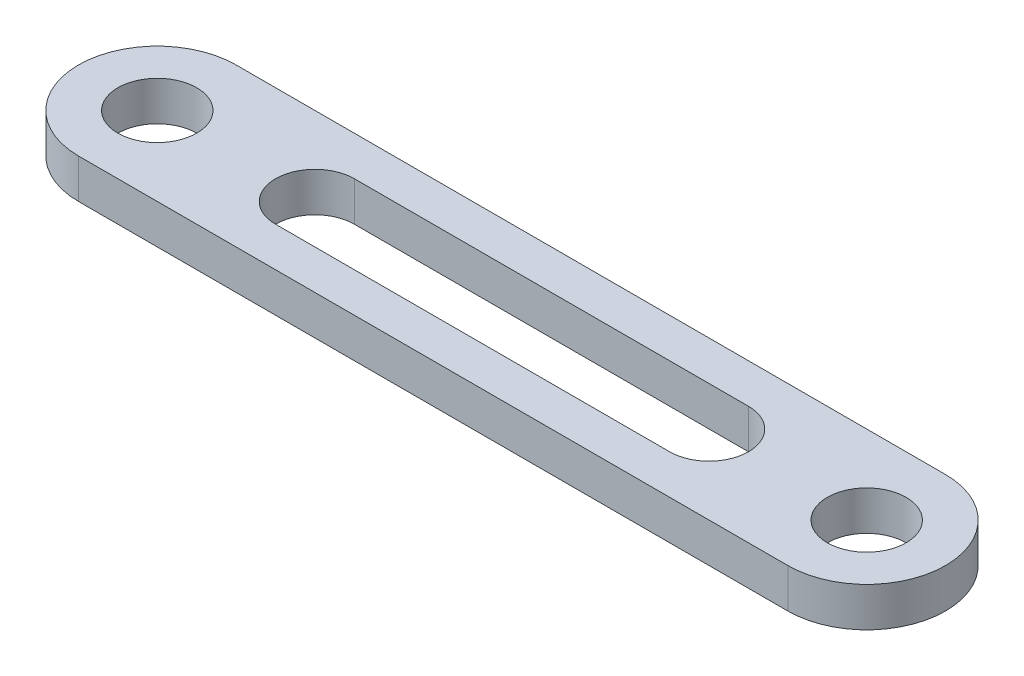
ISO-10303-21;
HEADER;
FILE_DESCRIPTION(('STEP AP214'),'2;1');
FILE_NAME('part.step','',(''),(''),'','','');
FILE_SCHEMA(('AUTOMOTIVE_DESIGN { 1 0 10303 214 1 1 1 1 }'));
ENDSEC;
DATA;
#1=APPLICATION_CONTEXT('core data for automotive mechanical design processes');
#2=APPLICATION_PROTOCOL_DEFINITION('international standard','automotive_design',2000,#1);
#3=PRODUCT_CONTEXT('',#1,'mechanical');
#4=PRODUCT('Part','Part','',(#3));
#5=PRODUCT_RELATED_PRODUCT_CATEGORY('part','',(#4));
#6=PRODUCT_DEFINITION_FORMATION('','',#4);
#7=PRODUCT_DEFINITION_CONTEXT('part definition',#1,'design');
#8=PRODUCT_DEFINITION('design','',#6,#7);
#9=PRODUCT_DEFINITION_SHAPE('','',#8);
#10=(LENGTH_UNIT() NAMED_UNIT(*) SI_UNIT(.MILLI.,.METRE.));
#11=(NAMED_UNIT(*) PLANE_ANGLE_UNIT() SI_UNIT($,.RADIAN.));
#12=(NAMED_UNIT(*) SI_UNIT($,.STERADIAN.) SOLID_ANGLE_UNIT());
#13=UNCERTAINTY_MEASURE_WITH_UNIT(LENGTH_MEASURE(1.E-05),#10,'distance_accuracy_value','');
#14=(GEOMETRIC_REPRESENTATION_CONTEXT(3) GLOBAL_UNCERTAINTY_ASSIGNED_CONTEXT((#13)) GLOBAL_UNIT_ASSIGNED_CONTEXT((#10,
#11,#12)) REPRESENTATION_CONTEXT('',''));
#15=CARTESIAN_POINT('',(0.,0.,0.));
#16=DIRECTION('',(0.,0.,1.));
#17=DIRECTION('',(1.,0.,0.));
#18=AXIS2_PLACEMENT_3D('',#15,#16,#17);
#19=CARTESIAN_POINT('',(0.,5.,0.));
#20=DIRECTION('',(0.,1.,0.));
#21=DIRECTION('',(0.,0.,1.));
#22=AXIS2_PLACEMENT_3D('',#19,#20,#21);
#23=PLANE('',#22);
#24=CARTESIAN_POINT('',(0.,5.,0.));
#25=DIRECTION('',(0.,1.,0.));
#26=DIRECTION('',(0.,0.,1.));
#27=AXIS2_PLACEMENT_3D('',#24,#25,#26);
#28=CIRCLE('',#27,5.);
#29=CARTESIAN_POINT('',(0.,5.,5.));
#30=VERTEX_POINT('',#29);
#31=EDGE_CURVE('E140',#30,#30,#28,.T.);
#32=ORIENTED_EDGE('',*,*,#31,.F.);
#33=EDGE_LOOP('',(#32));
#34=FACE_BOUND('',#33,.T.);
#35=CARTESIAN_POINT('',(0.,5.,0.));
#36=DIRECTION('',(0.,1.,0.));
#37=DIRECTION('',(0.,0.,1.));
#38=AXIS2_PLACEMENT_3D('',#35,#36,#37);
#39=CIRCLE('',#38,10.);
#40=CARTESIAN_POINT('',(0.,5.,-9.99999999999999));
#41=VERTEX_POINT('',#40);
#42=CARTESIAN_POINT('',(0.,5.,9.99999999999999));
#43=VERTEX_POINT('',#42);
#44=EDGE_CURVE('E156',#41,#43,#39,.T.);
#45=ORIENTED_EDGE('',*,*,#44,.T.);
#46=DIRECTION('',(1.,0.,0.));
#47=VECTOR('',#46,1.);
#48=CARTESIAN_POINT('',(0.,5.,9.99999999999999));
#49=LINE('',#48,#47);
#50=CARTESIAN_POINT('',(90.,5.,9.99999999999998));
#51=VERTEX_POINT('',#50);
#52=EDGE_CURVE('E160',#43,#51,#49,.T.);
#53=ORIENTED_EDGE('',*,*,#52,.T.);
#54=CARTESIAN_POINT('',(90.,5.,0.));
#55=DIRECTION('',(0.,1.,0.));
#56=DIRECTION('',(0.,0.,1.));
#57=AXIS2_PLACEMENT_3D('',#54,#55,#56);
#58=CIRCLE('',#57,10.);
#59=CARTESIAN_POINT('',(90.,5.,-10.));
#60=VERTEX_POINT('',#59);
#61=EDGE_CURVE('E164',#51,#60,#58,.T.);
#62=ORIENTED_EDGE('',*,*,#61,.T.);
#63=DIRECTION('',(-1.,0.,0.));
#64=VECTOR('',#63,1.);
#65=CARTESIAN_POINT('',(0.,5.,-9.99999999999999));
#66=LINE('',#65,#64);
#67=EDGE_CURVE('E167',#60,#41,#66,.T.);
#68=ORIENTED_EDGE('',*,*,#67,.T.);
#69=EDGE_LOOP('',(#45,#53,#62,#68));
#70=FACE_BOUND('',#69,.T.);
#71=DIRECTION('',(1.,0.,0.));
#72=VECTOR('',#71,1.);
#73=CARTESIAN_POINT('',(20.,5.,4.99999999999999));
#74=LINE('',#73,#72);
#75=CARTESIAN_POINT('',(20.,5.,4.99999999999999));
#76=VERTEX_POINT('',#75);
#77=CARTESIAN_POINT('',(70.,5.,4.99999999999999));
#78=VERTEX_POINT('',#77);
#79=EDGE_CURVE('E113',#76,#78,#74,.T.);
#80=ORIENTED_EDGE('',*,*,#79,.F.);
#81=CARTESIAN_POINT('',(20.,5.,0.));
#82=DIRECTION('',(0.,1.,0.));
#83=DIRECTION('',(0.,0.,1.));
#84=AXIS2_PLACEMENT_3D('',#81,#82,#83);
#85=CIRCLE('',#84,5.);
#86=CARTESIAN_POINT('',(20.,5.,-5.));
#87=VERTEX_POINT('',#86);
#88=EDGE_CURVE('E104',#87,#76,#85,.T.);
#89=ORIENTED_EDGE('',*,*,#88,.F.);
#90=DIRECTION('',(-1.,0.,0.));
#91=VECTOR('',#90,1.);
#92=CARTESIAN_POINT('',(20.,5.,-5.));
#93=LINE('',#92,#91);
#94=CARTESIAN_POINT('',(70.,5.,-5.00000000000001));
#95=VERTEX_POINT('',#94);
#96=EDGE_CURVE('E132',#95,#87,#93,.T.);
#97=ORIENTED_EDGE('',*,*,#96,.F.);
#98=CARTESIAN_POINT('',(70.,5.,0.));
#99=DIRECTION('',(0.,1.,0.));
#100=DIRECTION('',(0.,0.,1.));
#101=AXIS2_PLACEMENT_3D('',#98,#99,#100);
#102=CIRCLE('',#101,5.);
#103=EDGE_CURVE('E127',#78,#95,#102,.T.);
#104=ORIENTED_EDGE('',*,*,#103,.F.);
#105=EDGE_LOOP('',(#80,#89,#97,#104));
#106=FACE_BOUND('',#105,.T.);
#107=CARTESIAN_POINT('',(90.,5.,0.));
#108=DIRECTION('',(0.,1.,0.));
#109=DIRECTION('',(0.,0.,1.));
#110=AXIS2_PLACEMENT_3D('',#107,#108,#109);
#111=CIRCLE('',#110,5.);
#112=CARTESIAN_POINT('',(90.,5.,5.));
#113=VERTEX_POINT('',#112);
#114=EDGE_CURVE('E258',#113,#113,#111,.T.);
#115=ORIENTED_EDGE('',*,*,#114,.F.);
#116=EDGE_LOOP('',(#115));
#117=FACE_BOUND('',#116,.T.);
#118=ADVANCED_FACE('F38',(#34,#70,#106,#117),#23,.T.);
#119=CARTESIAN_POINT('',(0.,0.,0.));
#120=DIRECTION('',(0.,1.,0.));
#121=DIRECTION('',(0.,0.,1.));
#122=AXIS2_PLACEMENT_3D('',#119,#120,#121);
#123=PLANE('',#122);
#124=CARTESIAN_POINT('',(0.,0.,0.));
#125=DIRECTION('',(0.,1.,0.));
#126=DIRECTION('',(0.,0.,1.));
#127=AXIS2_PLACEMENT_3D('',#124,#125,#126);
#128=CIRCLE('',#127,10.);
#129=CARTESIAN_POINT('',(0.,0.,-9.99999999999999));
#130=VERTEX_POINT('',#129);
#131=CARTESIAN_POINT('',(0.,0.,9.99999999999999));
#132=VERTEX_POINT('',#131);
#133=EDGE_CURVE('E122',#130,#132,#128,.T.);
#134=ORIENTED_EDGE('',*,*,#133,.F.);
#135=DIRECTION('',(-1.,0.,0.));
#136=VECTOR('',#135,1.);
#137=CARTESIAN_POINT('',(0.,0.,-9.99999999999999));
#138=LINE('',#137,#136);
#139=CARTESIAN_POINT('',(90.,0.,-10.));
#140=VERTEX_POINT('',#139);
#141=EDGE_CURVE('E161',#140,#130,#138,.T.);
#142=ORIENTED_EDGE('',*,*,#141,.F.);
#143=CARTESIAN_POINT('',(90.,0.,0.));
#144=DIRECTION('',(0.,1.,0.));
#145=DIRECTION('',(0.,0.,1.));
#146=AXIS2_PLACEMENT_3D('',#143,#144,#145);
#147=CIRCLE('',#146,10.);
#148=CARTESIAN_POINT('',(90.,0.,9.99999999999998));
#149=VERTEX_POINT('',#148);
#150=EDGE_CURVE('E177',#149,#140,#147,.T.);
#151=ORIENTED_EDGE('',*,*,#150,.F.);
#152=DIRECTION('',(1.,0.,0.));
#153=VECTOR('',#152,1.);
#154=CARTESIAN_POINT('',(0.,0.,9.99999999999999));
#155=LINE('',#154,#153);
#156=EDGE_CURVE('E174',#132,#149,#155,.T.);
#157=ORIENTED_EDGE('',*,*,#156,.F.);
#158=EDGE_LOOP('',(#134,#142,#151,#157));
#159=FACE_BOUND('',#158,.T.);
#160=CARTESIAN_POINT('',(20.,0.,0.));
#161=DIRECTION('',(0.,1.,0.));
#162=DIRECTION('',(0.,0.,1.));
#163=AXIS2_PLACEMENT_3D('',#160,#161,#162);
#164=CIRCLE('',#163,5.);
#165=CARTESIAN_POINT('',(20.,0.,-5.));
#166=VERTEX_POINT('',#165);
#167=CARTESIAN_POINT('',(20.,0.,4.99999999999999));
#168=VERTEX_POINT('',#167);
#169=EDGE_CURVE('E62',#166,#168,#164,.T.);
#170=ORIENTED_EDGE('',*,*,#169,.T.);
#171=DIRECTION('',(1.,0.,0.));
#172=VECTOR('',#171,1.);
#173=CARTESIAN_POINT('',(20.,0.,4.99999999999999));
#174=LINE('',#173,#172);
#175=CARTESIAN_POINT('',(70.,0.,4.99999999999999));
#176=VERTEX_POINT('',#175);
#177=EDGE_CURVE('E120',#168,#176,#174,.T.);
#178=ORIENTED_EDGE('',*,*,#177,.T.);
#179=CARTESIAN_POINT('',(70.,0.,0.));
#180=DIRECTION('',(0.,1.,0.));
#181=DIRECTION('',(0.,0.,1.));
#182=AXIS2_PLACEMENT_3D('',#179,#180,#181);
#183=CIRCLE('',#182,5.);
#184=CARTESIAN_POINT('',(70.,0.,-5.00000000000001));
#185=VERTEX_POINT('',#184);
#186=EDGE_CURVE('E143',#176,#185,#183,.T.);
#187=ORIENTED_EDGE('',*,*,#186,.T.);
#188=DIRECTION('',(-1.,0.,0.));
#189=VECTOR('',#188,1.);
#190=CARTESIAN_POINT('',(20.,0.,-5.));
#191=LINE('',#190,#189);
#192=EDGE_CURVE('E114',#185,#166,#191,.T.);
#193=ORIENTED_EDGE('',*,*,#192,.T.);
#194=EDGE_LOOP('',(#170,#178,#187,#193));
#195=FACE_BOUND('',#194,.T.);
#196=CARTESIAN_POINT('',(0.,0.,0.));
#197=DIRECTION('',(0.,1.,0.));
#198=DIRECTION('',(0.,0.,1.));
#199=AXIS2_PLACEMENT_3D('',#196,#197,#198);
#200=CIRCLE('',#199,5.);
#201=CARTESIAN_POINT('',(0.,0.,5.));
#202=VERTEX_POINT('',#201);
#203=EDGE_CURVE('E267',#202,#202,#200,.T.);
#204=ORIENTED_EDGE('',*,*,#203,.T.);
#205=EDGE_LOOP('',(#204));
#206=FACE_BOUND('',#205,.T.);
#207=CARTESIAN_POINT('',(90.,0.,0.));
#208=DIRECTION('',(0.,1.,0.));
#209=DIRECTION('',(0.,0.,1.));
#210=AXIS2_PLACEMENT_3D('',#207,#208,#209);
#211=CIRCLE('',#210,5.);
#212=CARTESIAN_POINT('',(90.,0.,5.));
#213=VERTEX_POINT('',#212);
#214=EDGE_CURVE('E261',#213,#213,#211,.T.);
#215=ORIENTED_EDGE('',*,*,#214,.T.);
#216=EDGE_LOOP('',(#215));
#217=FACE_BOUND('',#216,.T.);
#218=ADVANCED_FACE('F201',(#159,#195,#206,#217),#123,.F.);
#219=CARTESIAN_POINT('',(0.,5.,0.));
#220=DIRECTION('',(0.,-1.,0.));
#221=DIRECTION('',(0.,0.,-1.));
#222=AXIS2_PLACEMENT_3D('',#219,#220,#221);
#223=CYLINDRICAL_SURFACE('',#222,10.);
#224=ORIENTED_EDGE('',*,*,#133,.T.);
#225=DIRECTION('',(0.,-1.,0.));
#226=VECTOR('',#225,1.);
#227=CARTESIAN_POINT('',(0.,5.,9.99999999999999));
#228=LINE('',#227,#226);
#229=EDGE_CURVE('E11',#43,#132,#228,.T.);
#230=ORIENTED_EDGE('',*,*,#229,.F.);
#231=ORIENTED_EDGE('',*,*,#44,.F.);
#232=DIRECTION('',(0.,-1.,0.));
#233=VECTOR('',#232,1.);
#234=CARTESIAN_POINT('',(0.,5.,-9.99999999999999));
#235=LINE('',#234,#233);
#236=EDGE_CURVE('E170',#41,#130,#235,.T.);
#237=ORIENTED_EDGE('',*,*,#236,.T.);
#238=EDGE_LOOP('',(#224,#230,#231,#237));
#239=FACE_BOUND('',#238,.T.);
#240=ADVANCED_FACE('F40',(#239),#223,.T.);
#241=CARTESIAN_POINT('',(0.,5.,9.99999999999999));
#242=DIRECTION('',(0.,0.,-1.));
#243=DIRECTION('',(-1.,0.,0.));
#244=AXIS2_PLACEMENT_3D('',#241,#242,#243);
#245=PLANE('',#244);
#246=ORIENTED_EDGE('',*,*,#156,.T.);
#247=DIRECTION('',(0.,-1.,0.));
#248=VECTOR('',#247,1.);
#249=CARTESIAN_POINT('',(90.,5.,9.99999999999998));
#250=LINE('',#249,#248);
#251=EDGE_CURVE('E47',#51,#149,#250,.T.);
#252=ORIENTED_EDGE('',*,*,#251,.F.);
#253=ORIENTED_EDGE('',*,*,#52,.F.);
#254=ORIENTED_EDGE('',*,*,#229,.T.);
#255=EDGE_LOOP('',(#246,#252,#253,#254));
#256=FACE_BOUND('',#255,.T.);
#257=ADVANCED_FACE('F211',(#256),#245,.F.);
#258=CARTESIAN_POINT('',(90.,5.,0.));
#259=DIRECTION('',(0.,-1.,0.));
#260=DIRECTION('',(0.,0.,-1.));
#261=AXIS2_PLACEMENT_3D('',#258,#259,#260);
#262=CYLINDRICAL_SURFACE('',#261,10.);
#263=ORIENTED_EDGE('',*,*,#150,.T.);
#264=DIRECTION('',(0.,-1.,0.));
#265=VECTOR('',#264,1.);
#266=CARTESIAN_POINT('',(90.,5.,-10.));
#267=LINE('',#266,#265);
#268=EDGE_CURVE('E185',#60,#140,#267,.T.);
#269=ORIENTED_EDGE('',*,*,#268,.F.);
#270=ORIENTED_EDGE('',*,*,#61,.F.);
#271=ORIENTED_EDGE('',*,*,#251,.T.);
#272=EDGE_LOOP('',(#263,#269,#270,#271));
#273=FACE_BOUND('',#272,.T.);
#274=ADVANCED_FACE('F195',(#273),#262,.T.);
#275=CARTESIAN_POINT('',(0.,5.,-9.99999999999999));
#276=DIRECTION('',(0.,0.,1.));
#277=DIRECTION('',(1.,0.,0.));
#278=AXIS2_PLACEMENT_3D('',#275,#276,#277);
#279=PLANE('',#278);
#280=ORIENTED_EDGE('',*,*,#141,.T.);
#281=ORIENTED_EDGE('',*,*,#236,.F.);
#282=ORIENTED_EDGE('',*,*,#67,.F.);
#283=ORIENTED_EDGE('',*,*,#268,.T.);
#284=EDGE_LOOP('',(#280,#281,#282,#283));
#285=FACE_BOUND('',#284,.T.);
#286=ADVANCED_FACE('F205',(#285),#279,.F.);
#287=CARTESIAN_POINT('',(20.,5.,0.));
#288=DIRECTION('',(0.,-1.,0.));
#289=DIRECTION('',(0.,0.,-1.));
#290=AXIS2_PLACEMENT_3D('',#287,#288,#289);
#291=CYLINDRICAL_SURFACE('',#290,5.);
#292=ORIENTED_EDGE('',*,*,#169,.F.);
#293=DIRECTION('',(0.,-1.,0.));
#294=VECTOR('',#293,1.);
#295=CARTESIAN_POINT('',(20.,5.,-5.));
#296=LINE('',#295,#294);
#297=EDGE_CURVE('E108',#87,#166,#296,.T.);
#298=ORIENTED_EDGE('',*,*,#297,.F.);
#299=ORIENTED_EDGE('',*,*,#88,.T.);
#300=DIRECTION('',(0.,-1.,0.));
#301=VECTOR('',#300,1.);
#302=CARTESIAN_POINT('',(20.,5.,4.99999999999999));
#303=LINE('',#302,#301);
#304=EDGE_CURVE('E107',#76,#168,#303,.T.);
#305=ORIENTED_EDGE('',*,*,#304,.T.);
#306=EDGE_LOOP('',(#292,#298,#299,#305));
#307=FACE_BOUND('',#306,.T.);
#308=ADVANCED_FACE('F106',(#307),#291,.F.);
#309=CARTESIAN_POINT('',(20.,5.,4.99999999999999));
#310=DIRECTION('',(0.,0.,-1.));
#311=DIRECTION('',(-1.,0.,0.));
#312=AXIS2_PLACEMENT_3D('',#309,#310,#311);
#313=PLANE('',#312);
#314=ORIENTED_EDGE('',*,*,#177,.F.);
#315=ORIENTED_EDGE('',*,*,#304,.F.);
#316=ORIENTED_EDGE('',*,*,#79,.T.);
#317=DIRECTION('',(0.,-1.,0.));
#318=VECTOR('',#317,1.);
#319=CARTESIAN_POINT('',(70.,5.,4.99999999999999));
#320=LINE('',#319,#318);
#321=EDGE_CURVE('E123',#78,#176,#320,.T.);
#322=ORIENTED_EDGE('',*,*,#321,.T.);
#323=EDGE_LOOP('',(#314,#315,#316,#322));
#324=FACE_BOUND('',#323,.T.);
#325=ADVANCED_FACE('F117',(#324),#313,.T.);
#326=CARTESIAN_POINT('',(70.,5.,0.));
#327=DIRECTION('',(0.,-1.,0.));
#328=DIRECTION('',(0.,0.,-1.));
#329=AXIS2_PLACEMENT_3D('',#326,#327,#328);
#330=CYLINDRICAL_SURFACE('',#329,5.);
#331=ORIENTED_EDGE('',*,*,#186,.F.);
#332=ORIENTED_EDGE('',*,*,#321,.F.);
#333=ORIENTED_EDGE('',*,*,#103,.T.);
#334=DIRECTION('',(0.,-1.,0.));
#335=VECTOR('',#334,1.);
#336=CARTESIAN_POINT('',(70.,5.,-5.00000000000001));
#337=LINE('',#336,#335);
#338=EDGE_CURVE('E54',#95,#185,#337,.T.);
#339=ORIENTED_EDGE('',*,*,#338,.T.);
#340=EDGE_LOOP('',(#331,#332,#333,#339));
#341=FACE_BOUND('',#340,.T.);
#342=ADVANCED_FACE('F236',(#341),#330,.F.);
#343=CARTESIAN_POINT('',(20.,5.,-5.));
#344=DIRECTION('',(0.,0.,1.));
#345=DIRECTION('',(1.,0.,0.));
#346=AXIS2_PLACEMENT_3D('',#343,#344,#345);
#347=PLANE('',#346);
#348=ORIENTED_EDGE('',*,*,#192,.F.);
#349=ORIENTED_EDGE('',*,*,#338,.F.);
#350=ORIENTED_EDGE('',*,*,#96,.T.);
#351=ORIENTED_EDGE('',*,*,#297,.T.);
#352=EDGE_LOOP('',(#348,#349,#350,#351));
#353=FACE_BOUND('',#352,.T.);
#354=ADVANCED_FACE('F240',(#353),#347,.T.);
#355=CARTESIAN_POINT('',(0.,5.,0.));
#356=DIRECTION('',(0.,-1.,0.));
#357=DIRECTION('',(0.,0.,-1.));
#358=AXIS2_PLACEMENT_3D('',#355,#356,#357);
#359=CYLINDRICAL_SURFACE('',#358,5.);
#360=ORIENTED_EDGE('',*,*,#31,.T.);
#361=EDGE_LOOP('',(#360));
#362=FACE_BOUND('',#361,.T.);
#363=ORIENTED_EDGE('',*,*,#203,.F.);
#364=EDGE_LOOP('',(#363));
#365=FACE_BOUND('',#364,.T.);
#366=ADVANCED_FACE('F246',(#362,#365),#359,.F.);
#367=CARTESIAN_POINT('',(90.,5.,0.));
#368=DIRECTION('',(0.,-1.,0.));
#369=DIRECTION('',(0.,0.,-1.));
#370=AXIS2_PLACEMENT_3D('',#367,#368,#369);
#371=CYLINDRICAL_SURFACE('',#370,5.);
#372=ORIENTED_EDGE('',*,*,#114,.T.);
#373=EDGE_LOOP('',(#372));
#374=FACE_BOUND('',#373,.T.);
#375=ORIENTED_EDGE('',*,*,#214,.F.);
#376=EDGE_LOOP('',(#375));
#377=FACE_BOUND('',#376,.T.);
#378=ADVANCED_FACE('F249',(#374,#377),#371,.F.);
#379=CLOSED_SHELL('',(#118,#218,#240,#257,#274,#286,#308,#325,#342,#354,#366,#378));
#380=MANIFOLD_SOLID_BREP('B2',#379);
#381=ADVANCED_BREP_SHAPE_REPRESENTATION('',(#18,#380),#14);
#382=SHAPE_DEFINITION_REPRESENTATION(#9,#381);
ENDSEC;
END-ISO-10303-21;
